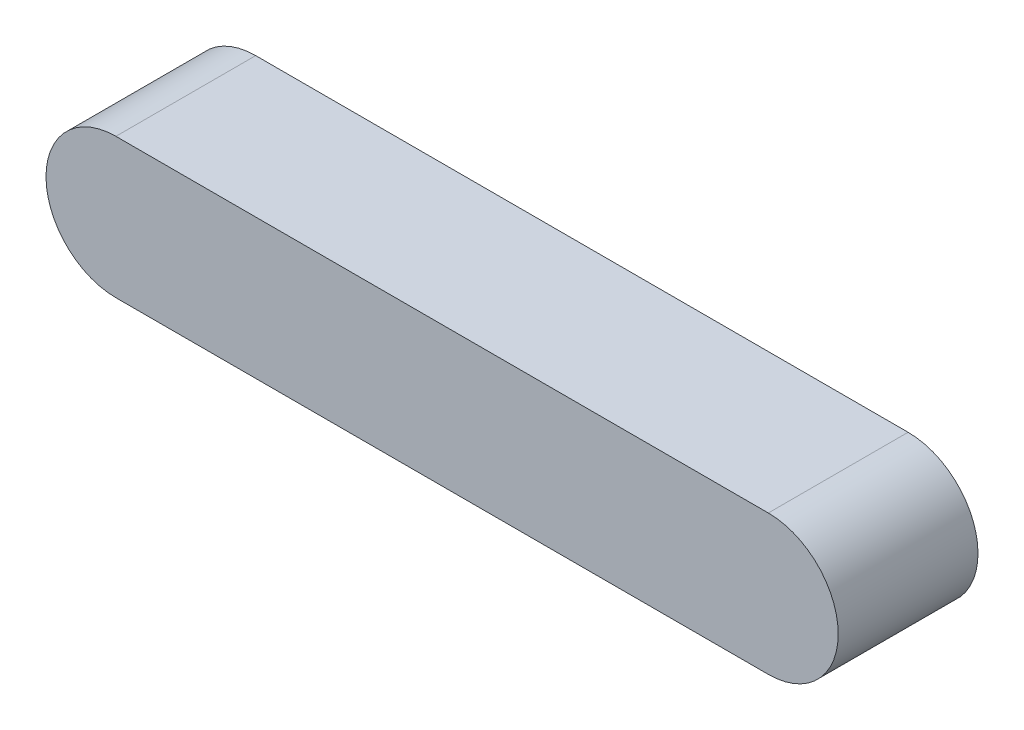
ISO-10303-21;
HEADER;
FILE_DESCRIPTION(('STEP AP214'),'2;1');
FILE_NAME('part.step','',(''),(''),'','','');
FILE_SCHEMA(('AUTOMOTIVE_DESIGN { 1 0 10303 214 1 1 1 1 }'));
ENDSEC;
DATA;
#1=APPLICATION_CONTEXT('core data for automotive mechanical design processes');
#2=APPLICATION_PROTOCOL_DEFINITION('international standard','automotive_design',2000,#1);
#3=PRODUCT_CONTEXT('',#1,'mechanical');
#4=PRODUCT('Part','Part','',(#3));
#5=PRODUCT_RELATED_PRODUCT_CATEGORY('part','',(#4));
#6=PRODUCT_DEFINITION_FORMATION('','',#4);
#7=PRODUCT_DEFINITION_CONTEXT('part definition',#1,'design');
#8=PRODUCT_DEFINITION('design','',#6,#7);
#9=PRODUCT_DEFINITION_SHAPE('','',#8);
#10=(LENGTH_UNIT() NAMED_UNIT(*) SI_UNIT(.MILLI.,.METRE.));
#11=(NAMED_UNIT(*) PLANE_ANGLE_UNIT() SI_UNIT($,.RADIAN.));
#12=(NAMED_UNIT(*) SI_UNIT($,.STERADIAN.) SOLID_ANGLE_UNIT());
#13=UNCERTAINTY_MEASURE_WITH_UNIT(LENGTH_MEASURE(1.E-05),#10,'distance_accuracy_value','');
#14=(GEOMETRIC_REPRESENTATION_CONTEXT(3) GLOBAL_UNCERTAINTY_ASSIGNED_CONTEXT((#13)) GLOBAL_UNIT_ASSIGNED_CONTEXT((#10,
#11,#12)) REPRESENTATION_CONTEXT('',''));
#15=CARTESIAN_POINT('',(0.,0.,0.));
#16=DIRECTION('',(0.,0.,1.));
#17=DIRECTION('',(1.,0.,0.));
#18=AXIS2_PLACEMENT_3D('',#15,#16,#17);
#19=CARTESIAN_POINT('',(0.,7.49999999999999,15.));
#20=DIRECTION('',(0.,0.,-1.));
#21=DIRECTION('',(-1.,0.,0.));
#22=AXIS2_PLACEMENT_3D('',#19,#20,#21);
#23=CYLINDRICAL_SURFACE('',#22,7.49999999999999);
#24=CARTESIAN_POINT('',(0.,7.49999999999999,0.));
#25=DIRECTION('',(0.,0.,1.));
#26=DIRECTION('',(1.,0.,0.));
#27=AXIS2_PLACEMENT_3D('',#24,#25,#26);
#28=CIRCLE('',#27,7.49999999999999);
#29=CARTESIAN_POINT('',(0.,15.,0.));
#30=VERTEX_POINT('',#29);
#31=CARTESIAN_POINT('',(0.,0.,0.));
#32=VERTEX_POINT('',#31);
#33=EDGE_CURVE('E97',#30,#32,#28,.T.);
#34=ORIENTED_EDGE('',*,*,#33,.T.);
#35=DIRECTION('',(0.,0.,-1.));
#36=VECTOR('',#35,1.);
#37=CARTESIAN_POINT('',(0.,0.,15.));
#38=LINE('',#37,#36);
#39=CARTESIAN_POINT('',(0.,0.,15.));
#40=VERTEX_POINT('',#39);
#41=EDGE_CURVE('E11',#40,#32,#38,.T.);
#42=ORIENTED_EDGE('',*,*,#41,.F.);
#43=CARTESIAN_POINT('',(0.,7.49999999999999,15.));
#44=DIRECTION('',(0.,0.,1.));
#45=DIRECTION('',(1.,0.,0.));
#46=AXIS2_PLACEMENT_3D('',#43,#44,#45);
#47=CIRCLE('',#46,7.49999999999999);
#48=CARTESIAN_POINT('',(0.,15.,15.));
#49=VERTEX_POINT('',#48);
#50=EDGE_CURVE('E85',#49,#40,#47,.T.);
#51=ORIENTED_EDGE('',*,*,#50,.F.);
#52=DIRECTION('',(0.,0.,-1.));
#53=VECTOR('',#52,1.);
#54=CARTESIAN_POINT('',(0.,15.,15.));
#55=LINE('',#54,#53);
#56=EDGE_CURVE('E93',#49,#30,#55,.T.);
#57=ORIENTED_EDGE('',*,*,#56,.T.);
#58=EDGE_LOOP('',(#34,#42,#51,#57));
#59=FACE_BOUND('',#58,.T.);
#60=ADVANCED_FACE('F34',(#59),#23,.T.);
#61=CARTESIAN_POINT('',(0.,0.,15.));
#62=DIRECTION('',(0.,1.,0.));
#63=DIRECTION('',(0.,0.,1.));
#64=AXIS2_PLACEMENT_3D('',#61,#62,#63);
#65=PLANE('',#64);
#66=DIRECTION('',(1.,0.,0.));
#67=VECTOR('',#66,1.);
#68=CARTESIAN_POINT('',(0.,0.,0.));
#69=LINE('',#68,#67);
#70=CARTESIAN_POINT('',(70.,0.,0.));
#71=VERTEX_POINT('',#70);
#72=EDGE_CURVE('E89',#32,#71,#69,.T.);
#73=ORIENTED_EDGE('',*,*,#72,.T.);
#74=DIRECTION('',(0.,0.,-1.));
#75=VECTOR('',#74,1.);
#76=CARTESIAN_POINT('',(70.,0.,15.));
#77=LINE('',#76,#75);
#78=CARTESIAN_POINT('',(70.,0.,15.));
#79=VERTEX_POINT('',#78);
#80=EDGE_CURVE('E42',#79,#71,#77,.T.);
#81=ORIENTED_EDGE('',*,*,#80,.F.);
#82=DIRECTION('',(1.,0.,0.));
#83=VECTOR('',#82,1.);
#84=CARTESIAN_POINT('',(0.,0.,15.));
#85=LINE('',#84,#83);
#86=EDGE_CURVE('E80',#40,#79,#85,.T.);
#87=ORIENTED_EDGE('',*,*,#86,.F.);
#88=ORIENTED_EDGE('',*,*,#41,.T.);
#89=EDGE_LOOP('',(#73,#81,#87,#88));
#90=FACE_BOUND('',#89,.T.);
#91=ADVANCED_FACE('F88',(#90),#65,.F.);
#92=CARTESIAN_POINT('',(70.,7.5,15.));
#93=DIRECTION('',(0.,0.,-1.));
#94=DIRECTION('',(-1.,0.,0.));
#95=AXIS2_PLACEMENT_3D('',#92,#93,#94);
#96=CYLINDRICAL_SURFACE('',#95,7.5);
#97=CARTESIAN_POINT('',(70.,7.5,0.));
#98=DIRECTION('',(0.,0.,1.));
#99=DIRECTION('',(1.,0.,0.));
#100=AXIS2_PLACEMENT_3D('',#97,#98,#99);
#101=CIRCLE('',#100,7.5);
#102=CARTESIAN_POINT('',(70.,15.,0.));
#103=VERTEX_POINT('',#102);
#104=EDGE_CURVE('E67',#71,#103,#101,.T.);
#105=ORIENTED_EDGE('',*,*,#104,.T.);
#106=DIRECTION('',(0.,0.,-1.));
#107=VECTOR('',#106,1.);
#108=CARTESIAN_POINT('',(70.,15.,15.));
#109=LINE('',#108,#107);
#110=CARTESIAN_POINT('',(70.,15.,15.));
#111=VERTEX_POINT('',#110);
#112=EDGE_CURVE('E90',#111,#103,#109,.T.);
#113=ORIENTED_EDGE('',*,*,#112,.F.);
#114=CARTESIAN_POINT('',(70.,7.5,15.));
#115=DIRECTION('',(0.,0.,1.));
#116=DIRECTION('',(1.,0.,0.));
#117=AXIS2_PLACEMENT_3D('',#114,#115,#116);
#118=CIRCLE('',#117,7.5);
#119=EDGE_CURVE('E83',#79,#111,#118,.T.);
#120=ORIENTED_EDGE('',*,*,#119,.F.);
#121=ORIENTED_EDGE('',*,*,#80,.T.);
#122=EDGE_LOOP('',(#105,#113,#120,#121));
#123=FACE_BOUND('',#122,.T.);
#124=ADVANCED_FACE('F91',(#123),#96,.T.);
#125=CARTESIAN_POINT('',(70.,15.,15.));
#126=DIRECTION('',(0.,-1.,0.));
#127=DIRECTION('',(1.,0.,0.));
#128=AXIS2_PLACEMENT_3D('',#125,#126,#127);
#129=PLANE('',#128);
#130=DIRECTION('',(-1.,0.,0.));
#131=VECTOR('',#130,1.);
#132=CARTESIAN_POINT('',(70.,15.,0.));
#133=LINE('',#132,#131);
#134=EDGE_CURVE('E73',#103,#30,#133,.T.);
#135=ORIENTED_EDGE('',*,*,#134,.T.);
#136=ORIENTED_EDGE('',*,*,#56,.F.);
#137=DIRECTION('',(-1.,0.,0.));
#138=VECTOR('',#137,1.);
#139=CARTESIAN_POINT('',(70.,15.,15.));
#140=LINE('',#139,#138);
#141=EDGE_CURVE('E50',#111,#49,#140,.T.);
#142=ORIENTED_EDGE('',*,*,#141,.F.);
#143=ORIENTED_EDGE('',*,*,#112,.T.);
#144=EDGE_LOOP('',(#135,#136,#142,#143));
#145=FACE_BOUND('',#144,.T.);
#146=ADVANCED_FACE('F104',(#145),#129,.F.);
#147=CARTESIAN_POINT('',(0.,7.49999999999999,15.));
#148=DIRECTION('',(0.,0.,1.));
#149=DIRECTION('',(1.,0.,0.));
#150=AXIS2_PLACEMENT_3D('',#147,#148,#149);
#151=PLANE('',#150);
#152=ORIENTED_EDGE('',*,*,#50,.T.);
#153=ORIENTED_EDGE('',*,*,#86,.T.);
#154=ORIENTED_EDGE('',*,*,#119,.T.);
#155=ORIENTED_EDGE('',*,*,#141,.T.);
#156=EDGE_LOOP('',(#152,#153,#154,#155));
#157=FACE_BOUND('',#156,.T.);
#158=ADVANCED_FACE('F81',(#157),#151,.T.);
#159=CARTESIAN_POINT('',(0.,7.49999999999999,0.));
#160=DIRECTION('',(0.,0.,1.));
#161=DIRECTION('',(1.,0.,0.));
#162=AXIS2_PLACEMENT_3D('',#159,#160,#161);
#163=PLANE('',#162);
#164=ORIENTED_EDGE('',*,*,#33,.F.);
#165=ORIENTED_EDGE('',*,*,#134,.F.);
#166=ORIENTED_EDGE('',*,*,#104,.F.);
#167=ORIENTED_EDGE('',*,*,#72,.F.);
#168=EDGE_LOOP('',(#164,#165,#166,#167));
#169=FACE_BOUND('',#168,.T.);
#170=ADVANCED_FACE('F107',(#169),#163,.F.);
#171=CLOSED_SHELL('',(#60,#91,#124,#146,#158,#170));
#172=MANIFOLD_SOLID_BREP('B2',#171);
#173=ADVANCED_BREP_SHAPE_REPRESENTATION('',(#18,#172),#14);
#174=SHAPE_DEFINITION_REPRESENTATION(#9,#173);
ENDSEC;
END-ISO-10303-21;
